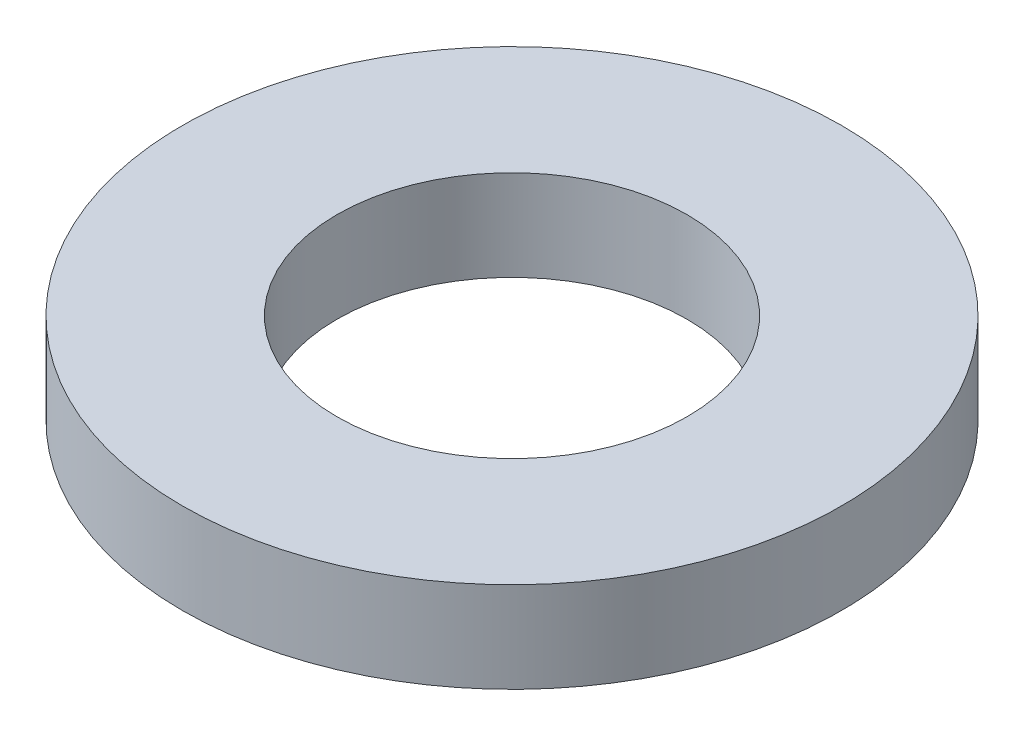
ISO-10303-21;
HEADER;
FILE_DESCRIPTION(('STEP AP214'),'2;1');
FILE_NAME('part.step','',(''),(''),'','','');
FILE_SCHEMA(('AUTOMOTIVE_DESIGN { 1 0 10303 214 1 1 1 1 }'));
ENDSEC;
DATA;
#1=APPLICATION_CONTEXT('core data for automotive mechanical design processes');
#2=APPLICATION_PROTOCOL_DEFINITION('international standard','automotive_design',2000,#1);
#3=PRODUCT_CONTEXT('',#1,'mechanical');
#4=PRODUCT('Part','Part','',(#3));
#5=PRODUCT_RELATED_PRODUCT_CATEGORY('part','',(#4));
#6=PRODUCT_DEFINITION_FORMATION('','',#4);
#7=PRODUCT_DEFINITION_CONTEXT('part definition',#1,'design');
#8=PRODUCT_DEFINITION('design','',#6,#7);
#9=PRODUCT_DEFINITION_SHAPE('','',#8);
#10=(LENGTH_UNIT() NAMED_UNIT(*) SI_UNIT(.MILLI.,.METRE.));
#11=(NAMED_UNIT(*) PLANE_ANGLE_UNIT() SI_UNIT($,.RADIAN.));
#12=(NAMED_UNIT(*) SI_UNIT($,.STERADIAN.) SOLID_ANGLE_UNIT());
#13=UNCERTAINTY_MEASURE_WITH_UNIT(LENGTH_MEASURE(1.E-05),#10,'distance_accuracy_value','');
#14=(GEOMETRIC_REPRESENTATION_CONTEXT(3) GLOBAL_UNCERTAINTY_ASSIGNED_CONTEXT((#13)) GLOBAL_UNIT_ASSIGNED_CONTEXT((#10,
#11,#12)) REPRESENTATION_CONTEXT('',''));
#15=CARTESIAN_POINT('',(0.,0.,0.));
#16=DIRECTION('',(0.,0.,1.));
#17=DIRECTION('',(1.,0.,0.));
#18=AXIS2_PLACEMENT_3D('',#15,#16,#17);
#19=CARTESIAN_POINT('',(0.,22.,0.));
#20=DIRECTION('',(0.,-1.,0.));
#21=DIRECTION('',(0.,0.,-1.));
#22=AXIS2_PLACEMENT_3D('',#19,#20,#21);
#23=CYLINDRICAL_SURFACE('',#22,80.);
#24=CARTESIAN_POINT('',(0.,22.,0.));
#25=DIRECTION('',(0.,1.,0.));
#26=DIRECTION('',(0.,0.,1.));
#27=AXIS2_PLACEMENT_3D('',#24,#25,#26);
#28=CIRCLE('',#27,80.);
#29=CARTESIAN_POINT('',(0.,22.,80.));
#30=VERTEX_POINT('',#29);
#31=EDGE_CURVE('E10',#30,#30,#28,.T.);
#32=ORIENTED_EDGE('',*,*,#31,.F.);
#33=EDGE_LOOP('',(#32));
#34=FACE_BOUND('',#33,.T.);
#35=CARTESIAN_POINT('',(0.,0.,0.));
#36=DIRECTION('',(0.,1.,0.));
#37=DIRECTION('',(0.,0.,1.));
#38=AXIS2_PLACEMENT_3D('',#35,#36,#37);
#39=CIRCLE('',#38,80.);
#40=CARTESIAN_POINT('',(0.,0.,80.));
#41=VERTEX_POINT('',#40);
#42=EDGE_CURVE('E37',#41,#41,#39,.T.);
#43=ORIENTED_EDGE('',*,*,#42,.T.);
#44=EDGE_LOOP('',(#43));
#45=FACE_BOUND('',#44,.T.);
#46=ADVANCED_FACE('F40',(#34,#45),#23,.T.);
#47=CARTESIAN_POINT('',(0.,22.,0.));
#48=DIRECTION('',(0.,1.,0.));
#49=DIRECTION('',(0.,0.,1.));
#50=AXIS2_PLACEMENT_3D('',#47,#48,#49);
#51=PLANE('',#50);
#52=CARTESIAN_POINT('',(0.,22.,0.));
#53=DIRECTION('',(0.,1.,0.));
#54=DIRECTION('',(0.,0.,1.));
#55=AXIS2_PLACEMENT_3D('',#52,#53,#54);
#56=CIRCLE('',#55,42.5);
#57=CARTESIAN_POINT('',(0.,22.,42.5));
#58=VERTEX_POINT('',#57);
#59=EDGE_CURVE('E50',#58,#58,#56,.T.);
#60=ORIENTED_EDGE('',*,*,#59,.F.);
#61=EDGE_LOOP('',(#60));
#62=FACE_BOUND('',#61,.T.);
#63=ORIENTED_EDGE('',*,*,#31,.T.);
#64=EDGE_LOOP('',(#63));
#65=FACE_BOUND('',#64,.T.);
#66=ADVANCED_FACE('F59',(#62,#65),#51,.T.);
#67=CARTESIAN_POINT('',(0.,0.,0.));
#68=DIRECTION('',(0.,1.,0.));
#69=DIRECTION('',(0.,0.,1.));
#70=AXIS2_PLACEMENT_3D('',#67,#68,#69);
#71=PLANE('',#70);
#72=CARTESIAN_POINT('',(0.,0.,0.));
#73=DIRECTION('',(0.,1.,0.));
#74=DIRECTION('',(0.,0.,1.));
#75=AXIS2_PLACEMENT_3D('',#72,#73,#74);
#76=CIRCLE('',#75,42.5);
#77=CARTESIAN_POINT('',(0.,0.,42.5));
#78=VERTEX_POINT('',#77);
#79=EDGE_CURVE('E47',#78,#78,#76,.T.);
#80=ORIENTED_EDGE('',*,*,#79,.T.);
#81=EDGE_LOOP('',(#80));
#82=FACE_BOUND('',#81,.T.);
#83=ORIENTED_EDGE('',*,*,#42,.F.);
#84=EDGE_LOOP('',(#83));
#85=FACE_BOUND('',#84,.T.);
#86=ADVANCED_FACE('F58',(#82,#85),#71,.F.);
#87=CARTESIAN_POINT('',(0.,22.,0.));
#88=DIRECTION('',(0.,-1.,0.));
#89=DIRECTION('',(0.,0.,-1.));
#90=AXIS2_PLACEMENT_3D('',#87,#88,#89);
#91=CYLINDRICAL_SURFACE('',#90,42.5);
#92=ORIENTED_EDGE('',*,*,#59,.T.);
#93=EDGE_LOOP('',(#92));
#94=FACE_BOUND('',#93,.T.);
#95=ORIENTED_EDGE('',*,*,#79,.F.);
#96=EDGE_LOOP('',(#95));
#97=FACE_BOUND('',#96,.T.);
#98=ADVANCED_FACE('F54',(#94,#97),#91,.F.);
#99=CLOSED_SHELL('',(#46,#66,#86,#98));
#100=MANIFOLD_SOLID_BREP('B2',#99);
#101=ADVANCED_BREP_SHAPE_REPRESENTATION('',(#18,#100),#14);
#102=SHAPE_DEFINITION_REPRESENTATION(#9,#101);
ENDSEC;
END-ISO-10303-21;
